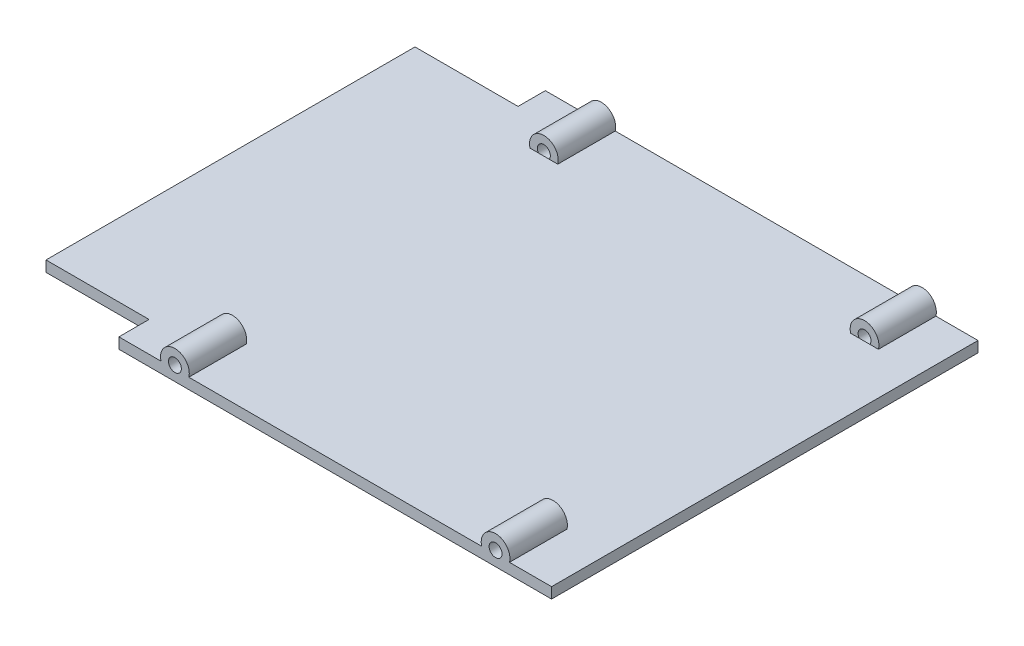
ISO-10303-21;
HEADER;
FILE_DESCRIPTION(('STEP AP214'),'2;1');
FILE_NAME('part.step','',(''),(''),'','','');
FILE_SCHEMA(('AUTOMOTIVE_DESIGN { 1 0 10303 214 1 1 1 1 }'));
ENDSEC;
DATA;
#1=APPLICATION_CONTEXT('core data for automotive mechanical design processes');
#2=APPLICATION_PROTOCOL_DEFINITION('international standard','automotive_design',2000,#1);
#3=PRODUCT_CONTEXT('',#1,'mechanical');
#4=PRODUCT('Part','Part','',(#3));
#5=PRODUCT_RELATED_PRODUCT_CATEGORY('part','',(#4));
#6=PRODUCT_DEFINITION_FORMATION('','',#4);
#7=PRODUCT_DEFINITION_CONTEXT('part definition',#1,'design');
#8=PRODUCT_DEFINITION('design','',#6,#7);
#9=PRODUCT_DEFINITION_SHAPE('','',#8);
#10=(LENGTH_UNIT() NAMED_UNIT(*) SI_UNIT(.MILLI.,.METRE.));
#11=(NAMED_UNIT(*) PLANE_ANGLE_UNIT() SI_UNIT($,.RADIAN.));
#12=(NAMED_UNIT(*) SI_UNIT($,.STERADIAN.) SOLID_ANGLE_UNIT());
#13=UNCERTAINTY_MEASURE_WITH_UNIT(LENGTH_MEASURE(1.E-05),#10,'distance_accuracy_value','');
#14=(GEOMETRIC_REPRESENTATION_CONTEXT(3) GLOBAL_UNCERTAINTY_ASSIGNED_CONTEXT((#13)) GLOBAL_UNIT_ASSIGNED_CONTEXT((#10,
#11,#12)) REPRESENTATION_CONTEXT('',''));
#15=CARTESIAN_POINT('',(0.,0.,0.));
#16=DIRECTION('',(0.,0.,1.));
#17=DIRECTION('',(1.,0.,0.));
#18=AXIS2_PLACEMENT_3D('',#15,#16,#17);
#19=CARTESIAN_POINT('',(-567.144993097305,-6.26719487480586,74.8561140107656));
#20=DIRECTION('',(-1.,0.,0.));
#21=DIRECTION('',(0.,0.,-1.));
#22=AXIS2_PLACEMENT_3D('',#19,#20,#21);
#23=PLANE('',#22);
#24=DIRECTION('',(0.,1.,0.));
#25=VECTOR('',#24,1.);
#26=CARTESIAN_POINT('',(-567.144993097307,-26.2671948748163,-40.9925552959329));
#27=LINE('',#26,#25);
#28=CARTESIAN_POINT('',(-567.144993097305,-26.2671948748163,-40.9925552959329));
#29=VERTEX_POINT('',#28);
#30=CARTESIAN_POINT('',(-567.144993097305,-24.7671948748163,-40.9925552959329));
#31=VERTEX_POINT('',#30);
#32=EDGE_CURVE('E246',#29,#31,#27,.T.);
#33=ORIENTED_EDGE('',*,*,#32,.T.);
#34=DIRECTION('',(0.,0.,-1.));
#35=VECTOR('',#34,1.);
#36=CARTESIAN_POINT('',(-567.144993097305,-24.7671948748163,74.8561140107656));
#37=LINE('',#36,#35);
#38=CARTESIAN_POINT('',(-567.144993097305,-24.7671948748163,-44.7925552959319));
#39=VERTEX_POINT('',#38);
#40=EDGE_CURVE('E301',#31,#39,#37,.T.);
#41=ORIENTED_EDGE('',*,*,#40,.T.);
#42=DIRECTION('',(0.,-1.,0.));
#43=VECTOR('',#42,1.);
#44=CARTESIAN_POINT('',(-567.144993097305,-6.26719487480586,-44.7925552959319));
#45=LINE('',#44,#43);
#46=CARTESIAN_POINT('',(-567.144993097305,-26.2671948748163,-44.7925552959319));
#47=VERTEX_POINT('',#46);
#48=EDGE_CURVE('E271',#39,#47,#45,.T.);
#49=ORIENTED_EDGE('',*,*,#48,.T.);
#50=DIRECTION('',(0.,0.,-1.));
#51=VECTOR('',#50,1.);
#52=CARTESIAN_POINT('',(-567.144993097305,-26.2671948748163,74.8561140107656));
#53=LINE('',#52,#51);
#54=EDGE_CURVE('E296',#29,#47,#53,.T.);
#55=ORIENTED_EDGE('',*,*,#54,.F.);
#56=EDGE_LOOP('',(#33,#41,#49,#55));
#57=FACE_BOUND('',#56,.T.);
#58=ADVANCED_FACE('F41',(#57),#23,.T.);
#59=CARTESIAN_POINT('',(-391.344993097289,-6.26719487480598,14.5874447040671));
#60=DIRECTION('',(0.,0.,1.));
#61=DIRECTION('',(-1.,0.,0.));
#62=AXIS2_PLACEMENT_3D('',#59,#60,#61);
#63=PLANE('',#62);
#64=CARTESIAN_POINT('',(-559.344993097226,-24.2671948748052,14.5874447040671));
#65=DIRECTION('',(0.,0.,-1.));
#66=DIRECTION('',(0.,1.,0.));
#67=AXIS2_PLACEMENT_3D('',#64,#65,#66);
#68=CIRCLE('',#67,0.900000000010855);
#69=CARTESIAN_POINT('',(-559.344993097226,-23.3671948747944,14.5874447040671));
#70=VERTEX_POINT('',#69);
#71=EDGE_CURVE('E209',#70,#70,#68,.T.);
#72=ORIENTED_EDGE('',*,*,#71,.T.);
#73=EDGE_LOOP('',(#72));
#74=FACE_BOUND('',#73,.T.);
#75=CARTESIAN_POINT('',(-514.694993097289,-24.2671948748052,14.5874447040671));
#76=DIRECTION('',(0.,0.,-1.));
#77=DIRECTION('',(0.,1.,0.));
#78=AXIS2_PLACEMENT_3D('',#75,#76,#77);
#79=CIRCLE('',#78,0.900000000010855);
#80=CARTESIAN_POINT('',(-514.694993097289,-23.3671948747943,14.5874447040671));
#81=VERTEX_POINT('',#80);
#82=EDGE_CURVE('E212',#81,#81,#79,.T.);
#83=ORIENTED_EDGE('',*,*,#82,.T.);
#84=EDGE_LOOP('',(#83));
#85=FACE_BOUND('',#84,.T.);
#86=DIRECTION('',(-1.,0.,0.));
#87=VECTOR('',#86,1.);
#88=CARTESIAN_POINT('',(-391.34499309729,-24.7671948748163,14.5874447040671));
#89=LINE('',#88,#87);
#90=CARTESIAN_POINT('',(-561.281484769779,-24.7671948748163,14.5874447040671));
#91=VERTEX_POINT('',#90);
#92=CARTESIAN_POINT('',(-567.144993097305,-24.7671948748163,14.5874447040671));
#93=VERTEX_POINT('',#92);
#94=EDGE_CURVE('E303',#91,#93,#89,.T.);
#95=ORIENTED_EDGE('',*,*,#94,.T.);
#96=DIRECTION('',(0.,-1.,0.));
#97=VECTOR('',#96,1.);
#98=CARTESIAN_POINT('',(-567.144993097305,-6.26719487480586,14.5874447040671));
#99=LINE('',#98,#97);
#100=CARTESIAN_POINT('',(-567.144993097305,-26.2671948748163,14.5874447040671));
#101=VERTEX_POINT('',#100);
#102=EDGE_CURVE('E293',#93,#101,#99,.T.);
#103=ORIENTED_EDGE('',*,*,#102,.T.);
#104=DIRECTION('',(1.,0.,0.));
#105=VECTOR('',#104,1.);
#106=CARTESIAN_POINT('',(-391.34499309729,-26.2671948748163,14.5874447040671));
#107=LINE('',#106,#105);
#108=CARTESIAN_POINT('',(-506.894993097303,-26.2671948748163,14.5874447040671));
#109=VERTEX_POINT('',#108);
#110=EDGE_CURVE('E288',#101,#109,#107,.T.);
#111=ORIENTED_EDGE('',*,*,#110,.T.);
#112=DIRECTION('',(0.,1.,0.));
#113=VECTOR('',#112,1.);
#114=CARTESIAN_POINT('',(-506.894993097303,-6.26719487480586,14.5874447040671));
#115=LINE('',#114,#113);
#116=CARTESIAN_POINT('',(-506.894993097303,-24.7671948748163,14.5874447040671));
#117=VERTEX_POINT('',#116);
#118=EDGE_CURVE('E274',#109,#117,#115,.T.);
#119=ORIENTED_EDGE('',*,*,#118,.T.);
#120=CARTESIAN_POINT('',(-512.758501423529,-24.7671948748163,14.5874447040671));
#121=VERTEX_POINT('',#120);
#122=EDGE_CURVE('E298',#117,#121,#89,.T.);
#123=ORIENTED_EDGE('',*,*,#122,.T.);
#124=CARTESIAN_POINT('',(-514.694993097289,-24.2671948748052,14.5874447040671));
#125=DIRECTION('',(0.,0.,-1.));
#126=DIRECTION('',(0.,1.,0.));
#127=AXIS2_PLACEMENT_3D('',#124,#125,#126);
#128=CIRCLE('',#127,2.00000000063811);
#129=CARTESIAN_POINT('',(-516.631484771049,-24.7671948748163,14.5874447040671));
#130=VERTEX_POINT('',#129);
#131=EDGE_CURVE('E222',#130,#121,#128,.T.);
#132=ORIENTED_EDGE('',*,*,#131,.F.);
#133=CARTESIAN_POINT('',(-557.408501424673,-24.7671948748163,14.5874447040671));
#134=VERTEX_POINT('',#133);
#135=EDGE_CURVE('E302',#130,#134,#89,.T.);
#136=ORIENTED_EDGE('',*,*,#135,.T.);
#137=CARTESIAN_POINT('',(-559.344993097226,-24.2671948748052,14.5874447040671));
#138=DIRECTION('',(0.,0.,-1.));
#139=DIRECTION('',(0.,1.,0.));
#140=AXIS2_PLACEMENT_3D('',#137,#138,#139);
#141=CIRCLE('',#140,1.99999999946984);
#142=EDGE_CURVE('E219',#91,#134,#141,.T.);
#143=ORIENTED_EDGE('',*,*,#142,.F.);
#144=EDGE_LOOP('',(#95,#103,#111,#119,#123,#132,#136,#143));
#145=FACE_BOUND('',#144,.T.);
#146=ADVANCED_FACE('F43',(#74,#85,#145),#63,.T.);
#147=CARTESIAN_POINT('',(0.,0.,-44.7925552959312));
#148=DIRECTION('',(0.,0.,-1.));
#149=DIRECTION('',(1.,0.,0.));
#150=AXIS2_PLACEMENT_3D('',#147,#148,#149);
#151=PLANE('',#150);
#152=CARTESIAN_POINT('',(-514.694993097289,-24.2671948748052,-44.7925552959312));
#153=DIRECTION('',(0.,0.,1.));
#154=DIRECTION('',(1.,0.,0.));
#155=AXIS2_PLACEMENT_3D('',#152,#153,#154);
#156=CIRCLE('',#155,0.899999999982432);
#157=CARTESIAN_POINT('',(-513.794993097306,-24.2671948748052,-44.7925552959312));
#158=VERTEX_POINT('',#157);
#159=EDGE_CURVE('E369',#158,#158,#156,.T.);
#160=ORIENTED_EDGE('',*,*,#159,.T.);
#161=EDGE_LOOP('',(#160));
#162=FACE_BOUND('',#161,.T.);
#163=CARTESIAN_POINT('',(-559.344993097226,-24.2671948748052,-44.7925552959312));
#164=DIRECTION('',(0.,0.,1.));
#165=DIRECTION('',(1.,0.,0.));
#166=AXIS2_PLACEMENT_3D('',#163,#164,#165);
#167=CIRCLE('',#166,0.899999999982697);
#168=CARTESIAN_POINT('',(-558.444993097243,-24.2671948748052,-44.7925552959312));
#169=VERTEX_POINT('',#168);
#170=EDGE_CURVE('E179',#169,#169,#167,.T.);
#171=ORIENTED_EDGE('',*,*,#170,.T.);
#172=EDGE_LOOP('',(#171));
#173=FACE_BOUND('',#172,.T.);
#174=DIRECTION('',(-1.,0.,0.));
#175=VECTOR('',#174,1.);
#176=CARTESIAN_POINT('',(-391.34499309729,-24.7671948748163,-44.7925552959316));
#177=LINE('',#176,#175);
#178=CARTESIAN_POINT('',(-506.894993097303,-24.7671948748163,-44.7925552959318));
#179=VERTEX_POINT('',#178);
#180=CARTESIAN_POINT('',(-512.758501424418,-24.7671948748163,-44.7925552959312));
#181=VERTEX_POINT('',#180);
#182=EDGE_CURVE('E275',#179,#181,#177,.T.);
#183=ORIENTED_EDGE('',*,*,#182,.F.);
#184=DIRECTION('',(0.,1.,0.));
#185=VECTOR('',#184,1.);
#186=CARTESIAN_POINT('',(-506.894993097303,-6.26719487480586,-44.7925552959318));
#187=LINE('',#186,#185);
#188=CARTESIAN_POINT('',(-506.894993097303,-26.2671948748163,-44.7925552959318));
#189=VERTEX_POINT('',#188);
#190=EDGE_CURVE('E280',#189,#179,#187,.T.);
#191=ORIENTED_EDGE('',*,*,#190,.F.);
#192=DIRECTION('',(1.,0.,0.));
#193=VECTOR('',#192,1.);
#194=CARTESIAN_POINT('',(-391.34499309729,-26.2671948748163,-44.7925552959316));
#195=LINE('',#194,#193);
#196=EDGE_CURVE('E259',#47,#189,#195,.T.);
#197=ORIENTED_EDGE('',*,*,#196,.F.);
#198=ORIENTED_EDGE('',*,*,#48,.F.);
#199=CARTESIAN_POINT('',(-561.281484770346,-24.7671948748163,-44.7925552959318));
#200=VERTEX_POINT('',#199);
#201=EDGE_CURVE('E279',#200,#39,#177,.T.);
#202=ORIENTED_EDGE('',*,*,#201,.F.);
#203=CARTESIAN_POINT('',(-559.344993097226,-24.2671948748052,-44.7925552959312));
#204=DIRECTION('',(0.,0.,1.));
#205=DIRECTION('',(1.,0.,0.));
#206=AXIS2_PLACEMENT_3D('',#203,#204,#205);
#207=CIRCLE('',#206,2.00000000001844);
#208=CARTESIAN_POINT('',(-557.408501424106,-24.7671948748163,-44.7925552959312));
#209=VERTEX_POINT('',#208);
#210=EDGE_CURVE('E362',#209,#200,#207,.T.);
#211=ORIENTED_EDGE('',*,*,#210,.F.);
#212=CARTESIAN_POINT('',(-516.63148477016,-24.7671948748163,-44.7925552959318));
#213=VERTEX_POINT('',#212);
#214=EDGE_CURVE('E278',#213,#209,#177,.T.);
#215=ORIENTED_EDGE('',*,*,#214,.F.);
#216=CARTESIAN_POINT('',(-514.694993097289,-24.2671948748052,-44.7925552959312));
#217=DIRECTION('',(0.,0.,1.));
#218=DIRECTION('',(1.,0.,0.));
#219=AXIS2_PLACEMENT_3D('',#216,#217,#218);
#220=CIRCLE('',#219,1.99999999977756);
#221=EDGE_CURVE('E346',#181,#213,#220,.T.);
#222=ORIENTED_EDGE('',*,*,#221,.F.);
#223=EDGE_LOOP('',(#183,#191,#197,#198,#202,#211,#215,#222));
#224=FACE_BOUND('',#223,.T.);
#225=ADVANCED_FACE('F343',(#162,#173,#224),#151,.T.);
#226=CARTESIAN_POINT('',(-506.894993097303,-6.26719487480586,74.8561140107657));
#227=DIRECTION('',(1.,0.,0.));
#228=DIRECTION('',(0.,0.,1.));
#229=AXIS2_PLACEMENT_3D('',#226,#227,#228);
#230=PLANE('',#229);
#231=DIRECTION('',(0.,0.,-1.));
#232=VECTOR('',#231,1.);
#233=CARTESIAN_POINT('',(-506.894993097303,-26.2671948748163,74.8561140107657));
#234=LINE('',#233,#232);
#235=EDGE_CURVE('E291',#109,#189,#234,.T.);
#236=ORIENTED_EDGE('',*,*,#235,.T.);
#237=ORIENTED_EDGE('',*,*,#190,.T.);
#238=DIRECTION('',(0.,0.,-1.));
#239=VECTOR('',#238,1.);
#240=CARTESIAN_POINT('',(-506.894993097303,-24.7671948748163,74.8561140107657));
#241=LINE('',#240,#239);
#242=EDGE_CURVE('E287',#117,#179,#241,.T.);
#243=ORIENTED_EDGE('',*,*,#242,.F.);
#244=ORIENTED_EDGE('',*,*,#118,.F.);
#245=EDGE_LOOP('',(#236,#237,#243,#244));
#246=FACE_BOUND('',#245,.T.);
#247=ADVANCED_FACE('F338',(#246),#230,.T.);
#248=CARTESIAN_POINT('',(-391.34499309729,-24.7671948748163,74.8561140107658));
#249=DIRECTION('',(0.,1.,0.));
#250=DIRECTION('',(-1.,0.,0.));
#251=AXIS2_PLACEMENT_3D('',#248,#249,#250);
#252=PLANE('',#251);
#253=DIRECTION('',(0.,0.,-1.));
#254=VECTOR('',#253,1.);
#255=CARTESIAN_POINT('',(-561.281484770346,-24.7671948748163,-36.7925552959312));
#256=LINE('',#255,#254);
#257=CARTESIAN_POINT('',(-561.281484770346,-24.7671948748163,-36.7925552959312));
#258=VERTEX_POINT('',#257);
#259=EDGE_CURVE('E202',#258,#200,#256,.T.);
#260=ORIENTED_EDGE('',*,*,#259,.T.);
#261=ORIENTED_EDGE('',*,*,#201,.T.);
#262=ORIENTED_EDGE('',*,*,#40,.F.);
#263=DIRECTION('',(1.,0.,0.));
#264=VECTOR('',#263,1.);
#265=CARTESIAN_POINT('',(-633.096884113087,-24.7671948748114,-40.9925552959329));
#266=LINE('',#265,#264);
#267=CARTESIAN_POINT('',(-581.494993097289,-24.7671948748114,-40.9925552959329));
#268=VERTEX_POINT('',#267);
#269=EDGE_CURVE('E245',#268,#31,#266,.T.);
#270=ORIENTED_EDGE('',*,*,#269,.F.);
#271=DIRECTION('',(0.,0.,1.));
#272=VECTOR('',#271,1.);
#273=CARTESIAN_POINT('',(-581.494993097289,-24.7671948748153,-40.9925552959329));
#274=LINE('',#273,#272);
#275=CARTESIAN_POINT('',(-581.494993097289,-24.7671948748153,10.3874447040668));
#276=VERTEX_POINT('',#275);
#277=EDGE_CURVE('E262',#268,#276,#274,.T.);
#278=ORIENTED_EDGE('',*,*,#277,.T.);
#279=DIRECTION('',(1.,0.,0.));
#280=VECTOR('',#279,1.);
#281=CARTESIAN_POINT('',(-633.096884113087,-24.7671948748114,10.3874447040668));
#282=LINE('',#281,#280);
#283=CARTESIAN_POINT('',(-567.144993097305,-24.7671948748163,10.3874447040668));
#284=VERTEX_POINT('',#283);
#285=EDGE_CURVE('E255',#276,#284,#282,.T.);
#286=ORIENTED_EDGE('',*,*,#285,.T.);
#287=EDGE_CURVE('E297',#93,#284,#37,.T.);
#288=ORIENTED_EDGE('',*,*,#287,.F.);
#289=ORIENTED_EDGE('',*,*,#94,.F.);
#290=DIRECTION('',(0.,0.,1.));
#291=VECTOR('',#290,1.);
#292=CARTESIAN_POINT('',(-561.281484769779,-24.7671948748163,6.58744470406709));
#293=LINE('',#292,#291);
#294=CARTESIAN_POINT('',(-561.281484769779,-24.7671948748163,6.58744470406709));
#295=VERTEX_POINT('',#294);
#296=EDGE_CURVE('E239',#91,#295,#293,.F.);
#297=ORIENTED_EDGE('',*,*,#296,.T.);
#298=DIRECTION('',(-1.,0.,0.));
#299=VECTOR('',#298,1.);
#300=CARTESIAN_POINT('',(-391.34499309729,-24.7671948748163,6.58744470406708));
#301=LINE('',#300,#299);
#302=CARTESIAN_POINT('',(-560.093324574587,-24.7671948748163,6.58744470406709));
#303=VERTEX_POINT('',#302);
#304=EDGE_CURVE('E235',#303,#295,#301,.T.);
#305=ORIENTED_EDGE('',*,*,#304,.F.);
#306=CARTESIAN_POINT('',(-558.596661619866,-24.7671948748163,6.58744470406709));
#307=VERTEX_POINT('',#306);
#308=EDGE_CURVE('E240',#307,#303,#301,.T.);
#309=ORIENTED_EDGE('',*,*,#308,.F.);
#310=CARTESIAN_POINT('',(-557.408501424673,-24.7671948748163,6.58744470406709));
#311=VERTEX_POINT('',#310);
#312=EDGE_CURVE('E236',#311,#307,#301,.T.);
#313=ORIENTED_EDGE('',*,*,#312,.F.);
#314=DIRECTION('',(0.,0.,1.));
#315=VECTOR('',#314,1.);
#316=CARTESIAN_POINT('',(-557.408501424673,-24.7671948748163,6.58744470406709));
#317=LINE('',#316,#315);
#318=EDGE_CURVE('E243',#311,#134,#317,.T.);
#319=ORIENTED_EDGE('',*,*,#318,.T.);
#320=ORIENTED_EDGE('',*,*,#135,.F.);
#321=DIRECTION('',(0.,0.,1.));
#322=VECTOR('',#321,1.);
#323=CARTESIAN_POINT('',(-516.631484771049,-24.7671948748163,6.58744470406709));
#324=LINE('',#323,#322);
#325=CARTESIAN_POINT('',(-516.631484771049,-24.7671948748163,6.58744470406709));
#326=VERTEX_POINT('',#325);
#327=EDGE_CURVE('E229',#130,#326,#324,.F.);
#328=ORIENTED_EDGE('',*,*,#327,.T.);
#329=DIRECTION('',(-1.,0.,0.));
#330=VECTOR('',#329,1.);
#331=CARTESIAN_POINT('',(-391.34499309729,-24.7671948748163,6.58744470406708));
#332=LINE('',#331,#330);
#333=CARTESIAN_POINT('',(-515.443324574649,-24.7671948748163,6.58744470406709));
#334=VERTEX_POINT('',#333);
#335=EDGE_CURVE('E218',#334,#326,#332,.T.);
#336=ORIENTED_EDGE('',*,*,#335,.F.);
#337=CARTESIAN_POINT('',(-513.946661619928,-24.7671948748163,6.58744470406709));
#338=VERTEX_POINT('',#337);
#339=EDGE_CURVE('E230',#338,#334,#332,.T.);
#340=ORIENTED_EDGE('',*,*,#339,.F.);
#341=CARTESIAN_POINT('',(-512.758501423529,-24.7671948748163,6.58744470406709));
#342=VERTEX_POINT('',#341);
#343=EDGE_CURVE('E226',#342,#338,#332,.T.);
#344=ORIENTED_EDGE('',*,*,#343,.F.);
#345=DIRECTION('',(0.,0.,1.));
#346=VECTOR('',#345,1.);
#347=CARTESIAN_POINT('',(-512.758501423529,-24.7671948748163,6.58744470406709));
#348=LINE('',#347,#346);
#349=EDGE_CURVE('E233',#342,#121,#348,.T.);
#350=ORIENTED_EDGE('',*,*,#349,.T.);
#351=ORIENTED_EDGE('',*,*,#122,.F.);
#352=ORIENTED_EDGE('',*,*,#242,.T.);
#353=ORIENTED_EDGE('',*,*,#182,.T.);
#354=DIRECTION('',(0.,0.,-1.));
#355=VECTOR('',#354,1.);
#356=CARTESIAN_POINT('',(-512.758501424418,-24.7671948748163,-36.7925552959312));
#357=LINE('',#356,#355);
#358=CARTESIAN_POINT('',(-512.758501424418,-24.7671948748163,-36.7925552959312));
#359=VERTEX_POINT('',#358);
#360=EDGE_CURVE('E199',#181,#359,#357,.F.);
#361=ORIENTED_EDGE('',*,*,#360,.T.);
#362=DIRECTION('',(1.,0.,0.));
#363=VECTOR('',#362,1.);
#364=CARTESIAN_POINT('',(-391.34499309729,-24.7671948748163,-36.7925552959312));
#365=LINE('',#364,#363);
#366=CARTESIAN_POINT('',(-513.946661619963,-24.7671948748163,-36.7925552959312));
#367=VERTEX_POINT('',#366);
#368=EDGE_CURVE('E351',#367,#359,#365,.T.);
#369=ORIENTED_EDGE('',*,*,#368,.F.);
#370=CARTESIAN_POINT('',(-515.443324574615,-24.7671948748163,-36.7925552959312));
#371=VERTEX_POINT('',#370);
#372=EDGE_CURVE('E356',#371,#367,#365,.T.);
#373=ORIENTED_EDGE('',*,*,#372,.F.);
#374=CARTESIAN_POINT('',(-516.63148477016,-24.7671948748163,-36.7925552959312));
#375=VERTEX_POINT('',#374);
#376=EDGE_CURVE('E353',#375,#371,#365,.T.);
#377=ORIENTED_EDGE('',*,*,#376,.F.);
#378=DIRECTION('',(0.,0.,-1.));
#379=VECTOR('',#378,1.);
#380=CARTESIAN_POINT('',(-516.63148477016,-24.7671948748163,-36.7925552959312));
#381=LINE('',#380,#379);
#382=EDGE_CURVE('E198',#375,#213,#381,.T.);
#383=ORIENTED_EDGE('',*,*,#382,.T.);
#384=ORIENTED_EDGE('',*,*,#214,.T.);
#385=DIRECTION('',(0.,0.,-1.));
#386=VECTOR('',#385,1.);
#387=CARTESIAN_POINT('',(-557.408501424106,-24.7671948748163,-36.7925552959312));
#388=LINE('',#387,#386);
#389=CARTESIAN_POINT('',(-557.408501424106,-24.7671948748163,-36.7925552959312));
#390=VERTEX_POINT('',#389);
#391=EDGE_CURVE('E197',#209,#390,#388,.F.);
#392=ORIENTED_EDGE('',*,*,#391,.T.);
#393=DIRECTION('',(1.,0.,0.));
#394=VECTOR('',#393,1.);
#395=CARTESIAN_POINT('',(-391.34499309729,-24.7671948748163,-36.7925552959312));
#396=LINE('',#395,#394);
#397=CARTESIAN_POINT('',(-558.5966616199,-24.7671948748163,-36.7925552959312));
#398=VERTEX_POINT('',#397);
#399=EDGE_CURVE('E185',#398,#390,#396,.T.);
#400=ORIENTED_EDGE('',*,*,#399,.F.);
#401=CARTESIAN_POINT('',(-560.093324574553,-24.7671948748163,-36.7925552959312));
#402=VERTEX_POINT('',#401);
#403=EDGE_CURVE('E191',#402,#398,#396,.T.);
#404=ORIENTED_EDGE('',*,*,#403,.F.);
#405=EDGE_CURVE('E188',#258,#402,#396,.T.);
#406=ORIENTED_EDGE('',*,*,#405,.F.);
#407=EDGE_LOOP('',(#260,#261,#262,#270,#278,#286,#288,#289,#297,#305,#309,#313,#319,#320,#328,
#336,#340,#344,#350,#351,#352,#353,#361,#369,#373,#377,#383,#384,#392,#400,#404,#406));
#408=FACE_BOUND('',#407,.T.);
#409=ADVANCED_FACE('F195',(#408),#252,.T.);
#410=DIRECTION('',(0.,-1.,0.));
#411=VECTOR('',#410,1.);
#412=CARTESIAN_POINT('',(-567.144993097307,-24.7671948748163,10.3874447040668));
#413=LINE('',#412,#411);
#414=CARTESIAN_POINT('',(-567.144993097307,-26.2671948748163,10.3874447040668));
#415=VERTEX_POINT('',#414);
#416=EDGE_CURVE('E251',#284,#415,#413,.T.);
#417=ORIENTED_EDGE('',*,*,#416,.T.);
#418=EDGE_CURVE('E292',#101,#415,#53,.T.);
#419=ORIENTED_EDGE('',*,*,#418,.F.);
#420=ORIENTED_EDGE('',*,*,#102,.F.);
#421=ORIENTED_EDGE('',*,*,#287,.T.);
#422=EDGE_LOOP('',(#417,#419,#420,#421));
#423=FACE_BOUND('',#422,.T.);
#424=ADVANCED_FACE('F406',(#423),#23,.T.);
#425=CARTESIAN_POINT('',(-391.34499309729,-26.2671948748163,74.8561140107658));
#426=DIRECTION('',(0.,-1.,0.));
#427=DIRECTION('',(0.,0.,1.));
#428=AXIS2_PLACEMENT_3D('',#425,#426,#427);
#429=PLANE('',#428);
#430=ORIENTED_EDGE('',*,*,#235,.F.);
#431=ORIENTED_EDGE('',*,*,#110,.F.);
#432=ORIENTED_EDGE('',*,*,#418,.T.);
#433=DIRECTION('',(1.,0.,0.));
#434=VECTOR('',#433,1.);
#435=CARTESIAN_POINT('',(-633.096884113087,-26.2671948748114,10.3874447040668));
#436=LINE('',#435,#434);
#437=CARTESIAN_POINT('',(-581.494993097289,-26.2671948748153,10.3874447040668));
#438=VERTEX_POINT('',#437);
#439=EDGE_CURVE('E254',#438,#415,#436,.T.);
#440=ORIENTED_EDGE('',*,*,#439,.F.);
#441=DIRECTION('',(0.,0.,-1.));
#442=VECTOR('',#441,1.);
#443=CARTESIAN_POINT('',(-581.494993097289,-26.2671948748153,10.3874447040668));
#444=LINE('',#443,#442);
#445=CARTESIAN_POINT('',(-581.494993097289,-26.2671948748152,-40.9925552959329));
#446=VERTEX_POINT('',#445);
#447=EDGE_CURVE('E256',#438,#446,#444,.T.);
#448=ORIENTED_EDGE('',*,*,#447,.T.);
#449=DIRECTION('',(1.,0.,0.));
#450=VECTOR('',#449,1.);
#451=CARTESIAN_POINT('',(-633.096884113087,-26.2671948748114,-40.9925552959329));
#452=LINE('',#451,#450);
#453=EDGE_CURVE('E250',#446,#29,#452,.T.);
#454=ORIENTED_EDGE('',*,*,#453,.T.);
#455=ORIENTED_EDGE('',*,*,#54,.T.);
#456=ORIENTED_EDGE('',*,*,#196,.T.);
#457=EDGE_LOOP('',(#430,#431,#432,#440,#448,#454,#455,#456));
#458=FACE_BOUND('',#457,.T.);
#459=ADVANCED_FACE('F448',(#458),#429,.T.);
#460=CARTESIAN_POINT('',(-633.096884113087,-24.7671948748114,10.3874447040668));
#461=DIRECTION('',(0.,0.,-1.));
#462=DIRECTION('',(1.,0.,0.));
#463=AXIS2_PLACEMENT_3D('',#460,#461,#462);
#464=PLANE('',#463);
#465=DIRECTION('',(0.,-1.,0.));
#466=VECTOR('',#465,1.);
#467=CARTESIAN_POINT('',(-581.494993097289,-24.7671948748114,10.3874447040668));
#468=LINE('',#467,#466);
#469=EDGE_CURVE('E260',#276,#438,#468,.T.);
#470=ORIENTED_EDGE('',*,*,#469,.T.);
#471=ORIENTED_EDGE('',*,*,#439,.T.);
#472=ORIENTED_EDGE('',*,*,#416,.F.);
#473=ORIENTED_EDGE('',*,*,#285,.F.);
#474=EDGE_LOOP('',(#470,#471,#472,#473));
#475=FACE_BOUND('',#474,.T.);
#476=ADVANCED_FACE('F403',(#475),#464,.F.);
#477=CARTESIAN_POINT('',(-633.096884113087,-26.2671948748114,-40.9925552959329));
#478=DIRECTION('',(0.,0.,1.));
#479=DIRECTION('',(-1.,0.,0.));
#480=AXIS2_PLACEMENT_3D('',#477,#478,#479);
#481=PLANE('',#480);
#482=DIRECTION('',(0.,1.,0.));
#483=VECTOR('',#482,1.);
#484=CARTESIAN_POINT('',(-581.494993097289,-26.2671948748114,-40.9925552959329));
#485=LINE('',#484,#483);
#486=EDGE_CURVE('E249',#446,#268,#485,.T.);
#487=ORIENTED_EDGE('',*,*,#486,.T.);
#488=ORIENTED_EDGE('',*,*,#269,.T.);
#489=ORIENTED_EDGE('',*,*,#32,.F.);
#490=ORIENTED_EDGE('',*,*,#453,.F.);
#491=EDGE_LOOP('',(#487,#488,#489,#490));
#492=FACE_BOUND('',#491,.T.);
#493=ADVANCED_FACE('F395',(#492),#481,.F.);
#494=CARTESIAN_POINT('',(-581.494993097289,-23.2671948747867,-61.6318694149806));
#495=DIRECTION('',(-1.,0.,0.));
#496=DIRECTION('',(0.,0.,-1.));
#497=AXIS2_PLACEMENT_3D('',#494,#495,#496);
#498=PLANE('',#497);
#499=ORIENTED_EDGE('',*,*,#486,.F.);
#500=ORIENTED_EDGE('',*,*,#447,.F.);
#501=ORIENTED_EDGE('',*,*,#469,.F.);
#502=ORIENTED_EDGE('',*,*,#277,.F.);
#503=EDGE_LOOP('',(#499,#500,#501,#502));
#504=FACE_BOUND('',#503,.T.);
#505=ADVANCED_FACE('F399',(#504),#498,.T.);
#506=CARTESIAN_POINT('',(-514.694993097289,-24.2671948748052,6.58744470406709));
#507=DIRECTION('',(0.,0.,1.));
#508=DIRECTION('',(0.,1.,0.));
#509=AXIS2_PLACEMENT_3D('',#506,#507,#508);
#510=CYLINDRICAL_SURFACE('',#509,2.00000000063811);
#511=CARTESIAN_POINT('',(-514.694993097289,-24.2671948748052,6.58744470406709));
#512=DIRECTION('',(0.,0.,-1.));
#513=DIRECTION('',(0.,1.,0.));
#514=AXIS2_PLACEMENT_3D('',#511,#512,#513);
#515=CIRCLE('',#514,2.00000000063811);
#516=EDGE_CURVE('E208',#326,#342,#515,.T.);
#517=ORIENTED_EDGE('',*,*,#516,.F.);
#518=ORIENTED_EDGE('',*,*,#327,.F.);
#519=ORIENTED_EDGE('',*,*,#131,.T.);
#520=ORIENTED_EDGE('',*,*,#349,.F.);
#521=EDGE_LOOP('',(#517,#518,#519,#520));
#522=FACE_BOUND('',#521,.T.);
#523=ADVANCED_FACE('F331',(#522),#510,.T.);
#524=CARTESIAN_POINT('',(-514.694993097289,-24.2671948748052,6.58744470406709));
#525=DIRECTION('',(0.,0.,1.));
#526=DIRECTION('',(0.,1.,0.));
#527=AXIS2_PLACEMENT_3D('',#524,#525,#526);
#528=PLANE('',#527);
#529=ORIENTED_EDGE('',*,*,#335,.T.);
#530=ORIENTED_EDGE('',*,*,#516,.T.);
#531=ORIENTED_EDGE('',*,*,#343,.T.);
#532=CARTESIAN_POINT('',(-514.694993097289,-24.2671948748052,6.58744470406709));
#533=DIRECTION('',(0.,0.,-1.));
#534=DIRECTION('',(0.,1.,0.));
#535=AXIS2_PLACEMENT_3D('',#532,#533,#534);
#536=CIRCLE('',#535,0.900000000010855);
#537=EDGE_CURVE('E190',#334,#338,#536,.T.);
#538=ORIENTED_EDGE('',*,*,#537,.F.);
#539=EDGE_LOOP('',(#529,#530,#531,#538));
#540=FACE_BOUND('',#539,.T.);
#541=ADVANCED_FACE('F323',(#540),#528,.F.);
#542=CARTESIAN_POINT('',(-559.344993097226,-24.2671948748052,6.58744470406709));
#543=DIRECTION('',(0.,0.,1.));
#544=DIRECTION('',(0.,1.,0.));
#545=AXIS2_PLACEMENT_3D('',#542,#543,#544);
#546=CYLINDRICAL_SURFACE('',#545,1.99999999946984);
#547=CARTESIAN_POINT('',(-559.344993097226,-24.2671948748052,6.58744470406709));
#548=DIRECTION('',(0.,0.,-1.));
#549=DIRECTION('',(0.,1.,0.));
#550=AXIS2_PLACEMENT_3D('',#547,#548,#549);
#551=CIRCLE('',#550,1.99999999946984);
#552=EDGE_CURVE('E216',#295,#311,#551,.T.);
#553=ORIENTED_EDGE('',*,*,#552,.F.);
#554=ORIENTED_EDGE('',*,*,#296,.F.);
#555=ORIENTED_EDGE('',*,*,#142,.T.);
#556=ORIENTED_EDGE('',*,*,#318,.F.);
#557=EDGE_LOOP('',(#553,#554,#555,#556));
#558=FACE_BOUND('',#557,.T.);
#559=ADVANCED_FACE('F412',(#558),#546,.T.);
#560=CARTESIAN_POINT('',(-559.344993097226,-24.2671948748052,6.58744470406709));
#561=DIRECTION('',(0.,0.,1.));
#562=DIRECTION('',(0.,1.,0.));
#563=AXIS2_PLACEMENT_3D('',#560,#561,#562);
#564=PLANE('',#563);
#565=ORIENTED_EDGE('',*,*,#304,.T.);
#566=ORIENTED_EDGE('',*,*,#552,.T.);
#567=ORIENTED_EDGE('',*,*,#312,.T.);
#568=CARTESIAN_POINT('',(-559.344993097226,-24.2671948748052,6.58744470406709));
#569=DIRECTION('',(0.,0.,-1.));
#570=DIRECTION('',(0.,1.,0.));
#571=AXIS2_PLACEMENT_3D('',#568,#569,#570);
#572=CIRCLE('',#571,0.900000000010855);
#573=EDGE_CURVE('E310',#303,#307,#572,.T.);
#574=ORIENTED_EDGE('',*,*,#573,.F.);
#575=EDGE_LOOP('',(#565,#566,#567,#574));
#576=FACE_BOUND('',#575,.T.);
#577=ADVANCED_FACE('F417',(#576),#564,.F.);
#578=CARTESIAN_POINT('',(-559.344993097226,-24.2671948748052,6.58744470406709));
#579=DIRECTION('',(0.,0.,1.));
#580=DIRECTION('',(0.,1.,0.));
#581=AXIS2_PLACEMENT_3D('',#578,#579,#580);
#582=CYLINDRICAL_SURFACE('',#581,0.900000000010855);
#583=CARTESIAN_POINT('',(-559.344993097226,-24.2671948748052,6.58744470406709));
#584=DIRECTION('',(0.,0.,-1.));
#585=DIRECTION('',(0.,1.,0.));
#586=AXIS2_PLACEMENT_3D('',#583,#584,#585);
#587=CIRCLE('',#586,0.900000000010855);
#588=EDGE_CURVE('E206',#307,#303,#587,.T.);
#589=ORIENTED_EDGE('',*,*,#588,.T.);
#590=ORIENTED_EDGE('',*,*,#573,.T.);
#591=EDGE_LOOP('',(#589,#590));
#592=FACE_BOUND('',#591,.T.);
#593=ORIENTED_EDGE('',*,*,#71,.F.);
#594=EDGE_LOOP('',(#593));
#595=FACE_BOUND('',#594,.T.);
#596=ADVANCED_FACE('F423',(#592,#595),#582,.F.);
#597=CARTESIAN_POINT('',(-559.344993097226,-24.2671948748052,6.58744470406709));
#598=DIRECTION('',(0.,0.,1.));
#599=DIRECTION('',(0.,1.,0.));
#600=AXIS2_PLACEMENT_3D('',#597,#598,#599);
#601=PLANE('',#600);
#602=ORIENTED_EDGE('',*,*,#588,.F.);
#603=ORIENTED_EDGE('',*,*,#308,.T.);
#604=EDGE_LOOP('',(#602,#603));
#605=FACE_BOUND('',#604,.T.);
#606=ADVANCED_FACE('F421',(#605),#601,.T.);
#607=CARTESIAN_POINT('',(-514.694993097289,-24.2671948748052,6.58744470406709));
#608=DIRECTION('',(0.,0.,1.));
#609=DIRECTION('',(0.,1.,0.));
#610=AXIS2_PLACEMENT_3D('',#607,#608,#609);
#611=CYLINDRICAL_SURFACE('',#610,0.900000000010855);
#612=CARTESIAN_POINT('',(-514.694993097289,-24.2671948748052,6.58744470406709));
#613=DIRECTION('',(0.,0.,-1.));
#614=DIRECTION('',(0.,1.,0.));
#615=AXIS2_PLACEMENT_3D('',#612,#613,#614);
#616=CIRCLE('',#615,0.900000000010855);
#617=EDGE_CURVE('E203',#338,#334,#616,.T.);
#618=ORIENTED_EDGE('',*,*,#617,.T.);
#619=ORIENTED_EDGE('',*,*,#537,.T.);
#620=EDGE_LOOP('',(#618,#619));
#621=FACE_BOUND('',#620,.T.);
#622=ORIENTED_EDGE('',*,*,#82,.F.);
#623=EDGE_LOOP('',(#622));
#624=FACE_BOUND('',#623,.T.);
#625=ADVANCED_FACE('F316',(#621,#624),#611,.F.);
#626=CARTESIAN_POINT('',(-514.694993097289,-24.2671948748052,6.58744470406709));
#627=DIRECTION('',(0.,0.,1.));
#628=DIRECTION('',(0.,1.,0.));
#629=AXIS2_PLACEMENT_3D('',#626,#627,#628);
#630=PLANE('',#629);
#631=ORIENTED_EDGE('',*,*,#617,.F.);
#632=ORIENTED_EDGE('',*,*,#339,.T.);
#633=EDGE_LOOP('',(#631,#632));
#634=FACE_BOUND('',#633,.T.);
#635=ADVANCED_FACE('F433',(#634),#630,.T.);
#636=CARTESIAN_POINT('',(-514.694993097289,-24.2671948748052,-36.7925552959312));
#637=DIRECTION('',(0.,0.,-1.));
#638=DIRECTION('',(1.,0.,0.));
#639=AXIS2_PLACEMENT_3D('',#636,#637,#638);
#640=CYLINDRICAL_SURFACE('',#639,1.99999999977756);
#641=CARTESIAN_POINT('',(-514.694993097289,-24.2671948748052,-36.7925552959312));
#642=DIRECTION('',(0.,0.,1.));
#643=DIRECTION('',(1.,0.,0.));
#644=AXIS2_PLACEMENT_3D('',#641,#642,#643);
#645=CIRCLE('',#644,1.99999999977756);
#646=EDGE_CURVE('E359',#359,#375,#645,.T.);
#647=ORIENTED_EDGE('',*,*,#646,.F.);
#648=ORIENTED_EDGE('',*,*,#360,.F.);
#649=ORIENTED_EDGE('',*,*,#221,.T.);
#650=ORIENTED_EDGE('',*,*,#382,.F.);
#651=EDGE_LOOP('',(#647,#648,#649,#650));
#652=FACE_BOUND('',#651,.T.);
#653=ADVANCED_FACE('F382',(#652),#640,.T.);
#654=CARTESIAN_POINT('',(-514.694993097289,-24.2671948748052,-36.7925552959312));
#655=DIRECTION('',(0.,0.,-1.));
#656=DIRECTION('',(1.,0.,0.));
#657=AXIS2_PLACEMENT_3D('',#654,#655,#656);
#658=PLANE('',#657);
#659=ORIENTED_EDGE('',*,*,#368,.T.);
#660=ORIENTED_EDGE('',*,*,#646,.T.);
#661=ORIENTED_EDGE('',*,*,#376,.T.);
#662=CARTESIAN_POINT('',(-514.694993097289,-24.2671948748052,-36.7925552959312));
#663=DIRECTION('',(0.,0.,1.));
#664=DIRECTION('',(1.,0.,0.));
#665=AXIS2_PLACEMENT_3D('',#662,#663,#664);
#666=CIRCLE('',#665,0.899999999982432);
#667=EDGE_CURVE('E11',#367,#371,#666,.T.);
#668=ORIENTED_EDGE('',*,*,#667,.F.);
#669=EDGE_LOOP('',(#659,#660,#661,#668));
#670=FACE_BOUND('',#669,.T.);
#671=ADVANCED_FACE('F377',(#670),#658,.F.);
#672=CARTESIAN_POINT('',(-559.344993097226,-24.2671948748052,-36.7925552959312));
#673=DIRECTION('',(0.,0.,-1.));
#674=DIRECTION('',(1.,0.,0.));
#675=AXIS2_PLACEMENT_3D('',#672,#673,#674);
#676=CYLINDRICAL_SURFACE('',#675,2.00000000001844);
#677=CARTESIAN_POINT('',(-559.344993097226,-24.2671948748052,-36.7925552959312));
#678=DIRECTION('',(0.,0.,1.));
#679=DIRECTION('',(1.,0.,0.));
#680=AXIS2_PLACEMENT_3D('',#677,#678,#679);
#681=CIRCLE('',#680,2.00000000001844);
#682=EDGE_CURVE('E365',#390,#258,#681,.T.);
#683=ORIENTED_EDGE('',*,*,#682,.F.);
#684=ORIENTED_EDGE('',*,*,#391,.F.);
#685=ORIENTED_EDGE('',*,*,#210,.T.);
#686=ORIENTED_EDGE('',*,*,#259,.F.);
#687=EDGE_LOOP('',(#683,#684,#685,#686));
#688=FACE_BOUND('',#687,.T.);
#689=ADVANCED_FACE('F522',(#688),#676,.T.);
#690=CARTESIAN_POINT('',(-559.344993097226,-24.2671948748052,-36.7925552959312));
#691=DIRECTION('',(0.,0.,-1.));
#692=DIRECTION('',(1.,0.,0.));
#693=AXIS2_PLACEMENT_3D('',#690,#691,#692);
#694=PLANE('',#693);
#695=ORIENTED_EDGE('',*,*,#399,.T.);
#696=ORIENTED_EDGE('',*,*,#682,.T.);
#697=ORIENTED_EDGE('',*,*,#405,.T.);
#698=CARTESIAN_POINT('',(-559.344993097226,-24.2671948748052,-36.7925552959312));
#699=DIRECTION('',(0.,0.,1.));
#700=DIRECTION('',(1.,0.,0.));
#701=AXIS2_PLACEMENT_3D('',#698,#699,#700);
#702=CIRCLE('',#701,0.899999999982697);
#703=EDGE_CURVE('E49',#398,#402,#702,.T.);
#704=ORIENTED_EDGE('',*,*,#703,.F.);
#705=EDGE_LOOP('',(#695,#696,#697,#704));
#706=FACE_BOUND('',#705,.T.);
#707=ADVANCED_FACE('F183',(#706),#694,.F.);
#708=CARTESIAN_POINT('',(-559.344993097226,-24.2671948748052,-36.7925552959312));
#709=DIRECTION('',(0.,0.,-1.));
#710=DIRECTION('',(1.,0.,0.));
#711=AXIS2_PLACEMENT_3D('',#708,#709,#710);
#712=CYLINDRICAL_SURFACE('',#711,0.899999999982697);
#713=CARTESIAN_POINT('',(-559.344993097226,-24.2671948748052,-36.7925552959312));
#714=DIRECTION('',(0.,0.,1.));
#715=DIRECTION('',(1.,0.,0.));
#716=AXIS2_PLACEMENT_3D('',#713,#714,#715);
#717=CIRCLE('',#716,0.899999999982697);
#718=EDGE_CURVE('E61',#402,#398,#717,.T.);
#719=ORIENTED_EDGE('',*,*,#718,.T.);
#720=ORIENTED_EDGE('',*,*,#703,.T.);
#721=EDGE_LOOP('',(#719,#720));
#722=FACE_BOUND('',#721,.T.);
#723=ORIENTED_EDGE('',*,*,#170,.F.);
#724=EDGE_LOOP('',(#723));
#725=FACE_BOUND('',#724,.T.);
#726=ADVANCED_FACE('F176',(#722,#725),#712,.F.);
#727=CARTESIAN_POINT('',(-559.344993097226,-24.2671948748052,-36.7925552959312));
#728=DIRECTION('',(0.,0.,-1.));
#729=DIRECTION('',(1.,0.,0.));
#730=AXIS2_PLACEMENT_3D('',#727,#728,#729);
#731=PLANE('',#730);
#732=ORIENTED_EDGE('',*,*,#718,.F.);
#733=ORIENTED_EDGE('',*,*,#403,.T.);
#734=EDGE_LOOP('',(#732,#733));
#735=FACE_BOUND('',#734,.T.);
#736=ADVANCED_FACE('F192',(#735),#731,.T.);
#737=CARTESIAN_POINT('',(-514.694993097289,-24.2671948748052,-36.7925552959312));
#738=DIRECTION('',(0.,0.,-1.));
#739=DIRECTION('',(1.,0.,0.));
#740=AXIS2_PLACEMENT_3D('',#737,#738,#739);
#741=CYLINDRICAL_SURFACE('',#740,0.899999999982432);
#742=CARTESIAN_POINT('',(-514.694993097289,-24.2671948748052,-36.7925552959312));
#743=DIRECTION('',(0.,0.,1.));
#744=DIRECTION('',(1.,0.,0.));
#745=AXIS2_PLACEMENT_3D('',#742,#743,#744);
#746=CIRCLE('',#745,0.899999999982432);
#747=EDGE_CURVE('E55',#371,#367,#746,.T.);
#748=ORIENTED_EDGE('',*,*,#747,.T.);
#749=ORIENTED_EDGE('',*,*,#667,.T.);
#750=EDGE_LOOP('',(#748,#749));
#751=FACE_BOUND('',#750,.T.);
#752=ORIENTED_EDGE('',*,*,#159,.F.);
#753=EDGE_LOOP('',(#752));
#754=FACE_BOUND('',#753,.T.);
#755=ADVANCED_FACE('F374',(#751,#754),#741,.F.);
#756=CARTESIAN_POINT('',(-514.694993097289,-24.2671948748052,-36.7925552959312));
#757=DIRECTION('',(0.,0.,-1.));
#758=DIRECTION('',(1.,0.,0.));
#759=AXIS2_PLACEMENT_3D('',#756,#757,#758);
#760=PLANE('',#759);
#761=ORIENTED_EDGE('',*,*,#747,.F.);
#762=ORIENTED_EDGE('',*,*,#372,.T.);
#763=EDGE_LOOP('',(#761,#762));
#764=FACE_BOUND('',#763,.T.);
#765=ADVANCED_FACE('F379',(#764),#760,.T.);
#766=CLOSED_SHELL('',(#58,#146,#225,#247,#409,#424,#459,#476,#493,#505,#523,#541,#559,#577,#596,
#606,#625,#635,#653,#671,#689,#707,#726,#736,#755,#765));
#767=MANIFOLD_SOLID_BREP('B2',#766);
#768=ADVANCED_BREP_SHAPE_REPRESENTATION('',(#18,#767),#14);
#769=SHAPE_DEFINITION_REPRESENTATION(#9,#768);
ENDSEC;
END-ISO-10303-21;
